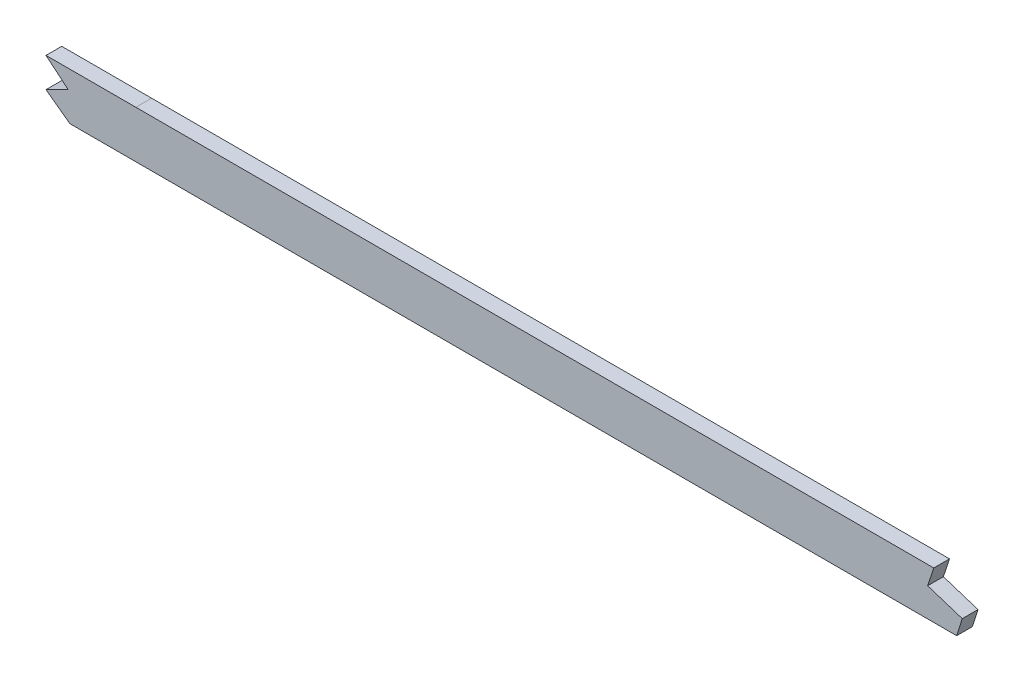
ISO-10303-21;
HEADER;
FILE_DESCRIPTION(('STEP AP214'),'2;1');
FILE_NAME('part.step','',(''),(''),'','','');
FILE_SCHEMA(('AUTOMOTIVE_DESIGN { 1 0 10303 214 1 1 1 1 }'));
ENDSEC;
DATA;
#1=APPLICATION_CONTEXT('core data for automotive mechanical design processes');
#2=APPLICATION_PROTOCOL_DEFINITION('international standard','automotive_design',2000,#1);
#3=PRODUCT_CONTEXT('',#1,'mechanical');
#4=PRODUCT('Part','Part','',(#3));
#5=PRODUCT_RELATED_PRODUCT_CATEGORY('part','',(#4));
#6=PRODUCT_DEFINITION_FORMATION('','',#4);
#7=PRODUCT_DEFINITION_CONTEXT('part definition',#1,'design');
#8=PRODUCT_DEFINITION('design','',#6,#7);
#9=PRODUCT_DEFINITION_SHAPE('','',#8);
#10=(LENGTH_UNIT() NAMED_UNIT(*) SI_UNIT(.MILLI.,.METRE.));
#11=(NAMED_UNIT(*) PLANE_ANGLE_UNIT() SI_UNIT($,.RADIAN.));
#12=(NAMED_UNIT(*) SI_UNIT($,.STERADIAN.) SOLID_ANGLE_UNIT());
#13=UNCERTAINTY_MEASURE_WITH_UNIT(LENGTH_MEASURE(1.E-05),#10,'distance_accuracy_value','');
#14=(GEOMETRIC_REPRESENTATION_CONTEXT(3) GLOBAL_UNCERTAINTY_ASSIGNED_CONTEXT((#13)) GLOBAL_UNIT_ASSIGNED_CONTEXT((#10,
#11,#12)) REPRESENTATION_CONTEXT('',''));
#15=CARTESIAN_POINT('',(0.,0.,0.));
#16=DIRECTION('',(0.,0.,1.));
#17=DIRECTION('',(1.,0.,0.));
#18=AXIS2_PLACEMENT_3D('',#15,#16,#17);
#19=CARTESIAN_POINT('',(499.61002795047,-34.4207027968771,3.175));
#20=CARTESIAN_POINT('',(488.614737518052,-34.4207027968771,3.175));
#21=CARTESIAN_POINT('',(472.2363953645,-34.4207027983821,3.175));
#22=CARTESIAN_POINT('',(449.940231846129,-34.420702794369,3.175));
#23=CARTESIAN_POINT('',(427.771305694794,-34.4207028104213,3.175));
#24=CARTESIAN_POINT('',(405.874681662796,-34.4207027121004,3.175));
#25=CARTESIAN_POINT('',(384.584909127846,-34.4207029418503,3.175));
#26=CARTESIAN_POINT('',(368.900229326161,-34.4207022443236,3.175));
#27=CARTESIAN_POINT('',(353.376568613047,-34.4207048621181,3.175));
#28=CARTESIAN_POINT('',(332.608466434546,-34.4206891858564,3.175));
#29=CARTESIAN_POINT('',(306.287754852687,-34.4205700055106,3.175));
#30=CARTESIAN_POINT('',(274.023487704489,-34.4205382555166,3.175));
#31=CARTESIAN_POINT('',(252.271015965112,-34.4207097406393,3.175));
#32=CARTESIAN_POINT('',(241.425150133728,-34.4207027610987,3.175));
#33=B_SPLINE_CURVE_WITH_KNOTS('',3,(#19,#20,#21,#22,#23,#24,#25,#26,#27,#28,#29,#30,#31,#32),
.UNSPECIFIED.,.F.,.F.,(4,1,1,1,1,1,1,1,1,1,1,4),(19.9068295096932,23.2201200173381,
24.8767652711605,26.5334105249829,29.8467010326278,31.5033462864503,33.1599915402727,
34.8166367940951,36.4732820479176,39.7865725555625,43.0998630632073,46.4131535708522),.UNSPECIFIED.);
#34=DIRECTION('',(0.,0.,-1.));
#35=VECTOR('',#34,1.);
#36=SURFACE_OF_LINEAR_EXTRUSION('',#33,#35);
#37=CARTESIAN_POINT('',(499.61002795047,-34.4207027968771,-3.175));
#38=CARTESIAN_POINT('',(488.614737518052,-34.4207027968771,-3.175));
#39=CARTESIAN_POINT('',(472.2363953645,-34.4207027983821,-3.175));
#40=CARTESIAN_POINT('',(449.940231846129,-34.420702794369,-3.175));
#41=CARTESIAN_POINT('',(427.771305694794,-34.4207028104213,-3.175));
#42=CARTESIAN_POINT('',(405.874681662796,-34.4207027121004,-3.175));
#43=CARTESIAN_POINT('',(384.584909127846,-34.4207029418503,-3.175));
#44=CARTESIAN_POINT('',(368.900229326161,-34.4207022443236,-3.175));
#45=CARTESIAN_POINT('',(353.376568613047,-34.4207048621181,-3.175));
#46=CARTESIAN_POINT('',(332.608466434546,-34.4206891858564,-3.175));
#47=CARTESIAN_POINT('',(306.287754852687,-34.4205700055106,-3.175));
#48=CARTESIAN_POINT('',(274.023487704489,-34.4205382555166,-3.175));
#49=CARTESIAN_POINT('',(252.271015965112,-34.4207097406393,-3.175));
#50=CARTESIAN_POINT('',(241.425150133728,-34.4207027610987,-3.175));
#51=B_SPLINE_CURVE_WITH_KNOTS('',3,(#37,#38,#39,#40,#41,#42,#43,#44,#45,#46,#47,#48,#49,#50),
.UNSPECIFIED.,.F.,.F.,(4,1,1,1,1,1,1,1,1,1,1,4),(19.9068295096932,23.2201200173381,
24.8767652711605,26.5334105249829,29.8467010326278,31.5033462864503,33.1599915402727,
34.8166367940951,36.4732820479176,39.7865725555625,43.0998630632073,46.4131535708522),.UNSPECIFIED.);
#52=CARTESIAN_POINT('',(499.61002795047,-34.4207027968771,-3.175));
#53=VERTEX_POINT('',#52);
#54=CARTESIAN_POINT('',(463.358597157252,-34.4207027965464,-3.175));
#55=VERTEX_POINT('',#54);
#56=EDGE_CURVE('E146',#53,#55,#51,.T.);
#57=ORIENTED_EDGE('',*,*,#56,.T.);
#58=DIRECTION('',(0.,0.,1.));
#59=VECTOR('',#58,1.);
#60=CARTESIAN_POINT('',(463.358597157252,-34.4207027965464,-4.445));
#61=LINE('',#60,#59);
#62=CARTESIAN_POINT('',(463.358597157252,-34.4207027965464,3.175));
#63=VERTEX_POINT('',#62);
#64=EDGE_CURVE('E147',#55,#63,#61,.T.);
#65=ORIENTED_EDGE('',*,*,#64,.T.);
#66=CARTESIAN_POINT('',(499.61002795047,-34.4207027968771,3.175));
#67=VERTEX_POINT('',#66);
#68=EDGE_CURVE('E173',#67,#63,#33,.T.);
#69=ORIENTED_EDGE('',*,*,#68,.F.);
#70=DIRECTION('',(0.,0.,-1.));
#71=VECTOR('',#70,1.);
#72=CARTESIAN_POINT('',(499.61002795047,-34.4207027968771,3.175));
#73=LINE('',#72,#71);
#74=EDGE_CURVE('E241',#67,#53,#73,.T.);
#75=ORIENTED_EDGE('',*,*,#74,.T.);
#76=EDGE_LOOP('',(#57,#65,#69,#75));
#77=FACE_BOUND('',#76,.T.);
#78=ADVANCED_FACE('F38',(#77),#36,.F.);
#79=CARTESIAN_POINT('',(499.61002795047,-53.4707027968771,3.175));
#80=CARTESIAN_POINT('',(492.13682083511,-53.4707027968771,3.175));
#81=CARTESIAN_POINT('',(484.754348064359,-53.4707027968771,3.175));
#82=CARTESIAN_POINT('',(477.443025858661,-53.4707027968771,3.175));
#83=CARTESIAN_POINT('',(448.516583144859,-53.4707027968771,3.175));
#84=CARTESIAN_POINT('',(419.590140516906,-53.4707027968771,3.175));
#85=CARTESIAN_POINT('',(398.368118521171,-53.4707027968771,3.175));
#86=CARTESIAN_POINT('',(355.647540185946,-53.4707027968771,3.175));
#87=CARTESIAN_POINT('',(312.926961850721,-53.4707027968771,3.175));
#88=CARTESIAN_POINT('',(289.235090436449,-53.4702930294301,3.175));
#89=CARTESIAN_POINT('',(265.364963651298,-53.4707050337029,3.175));
#90=CARTESIAN_POINT('',(241.494836900486,-53.4707027893221,3.175));
#91=CARTESIAN_POINT('',(241.471603890762,-53.470702784812,3.175));
#92=CARTESIAN_POINT('',(241.448370881994,-53.4707027760456,3.175));
#93=CARTESIAN_POINT('',(241.425137874656,-53.4707027610947,3.175));
#94=(BOUNDED_CURVE() B_SPLINE_CURVE(5,(#79,#80,#81,#82,#83,#84,#85,#86,#87,#88,#89,#90,#91,#92,
#93),.UNSPECIFIED.,.F.,.F.) B_SPLINE_CURVE_WITH_KNOTS((6,3,3,3,6),(19.9068295096932,
23.6378973105454,34.2765455705454,46.4013409005454,46.4131535708522),
.UNSPECIFIED.) CURVE() GEOMETRIC_REPRESENTATION_ITEM() RATIONAL_B_SPLINE_CURVE((1.,1.,1.,1.,1.,
1.,1.,1.,1.,1.,1.,1.,1.,1.,1.)) REPRESENTATION_ITEM(''));
#95=DIRECTION('',(0.,0.,-1.));
#96=VECTOR('',#95,1.);
#97=SURFACE_OF_LINEAR_EXTRUSION('',#94,#96);
#98=DIRECTION('',(0.,0.,1.));
#99=VECTOR('',#98,1.);
#100=CARTESIAN_POINT('',(472.997412796544,-53.4707027968771,-4.445));
#101=LINE('',#100,#99);
#102=CARTESIAN_POINT('',(472.997412796544,-53.4707027968771,-3.175));
#103=VERTEX_POINT('',#102);
#104=CARTESIAN_POINT('',(472.997412796544,-53.4707027968771,3.175));
#105=VERTEX_POINT('',#104);
#106=EDGE_CURVE('E130',#103,#105,#101,.T.);
#107=ORIENTED_EDGE('',*,*,#106,.F.);
#108=CARTESIAN_POINT('',(499.61002795047,-53.4707027968771,-3.175));
#109=CARTESIAN_POINT('',(492.13682083511,-53.4707027968771,-3.175));
#110=CARTESIAN_POINT('',(484.754348064359,-53.4707027968771,-3.175));
#111=CARTESIAN_POINT('',(477.443025858661,-53.4707027968771,-3.175));
#112=CARTESIAN_POINT('',(448.516583144859,-53.4707027968771,-3.175));
#113=CARTESIAN_POINT('',(419.590140516906,-53.4707027968771,-3.175));
#114=CARTESIAN_POINT('',(398.368118521171,-53.4707027968771,-3.175));
#115=CARTESIAN_POINT('',(355.647540185946,-53.4707027968771,-3.175));
#116=CARTESIAN_POINT('',(312.926961850721,-53.4707027968771,-3.175));
#117=CARTESIAN_POINT('',(289.235090436449,-53.4702930294301,-3.175));
#118=CARTESIAN_POINT('',(265.364963651298,-53.4707050337029,-3.175));
#119=CARTESIAN_POINT('',(241.494836900486,-53.4707027893221,-3.175));
#120=CARTESIAN_POINT('',(241.471603890762,-53.470702784812,-3.175));
#121=CARTESIAN_POINT('',(241.448370881994,-53.4707027760456,-3.175));
#122=CARTESIAN_POINT('',(241.425137874656,-53.4707027610947,-3.175));
#123=(BOUNDED_CURVE() B_SPLINE_CURVE(5,(#108,#109,#110,#111,#112,#113,#114,#115,#116,#117,#118,
#119,#120,#121,#122),.UNSPECIFIED.,.F.,.F.) B_SPLINE_CURVE_WITH_KNOTS((6,3,3,3,6),
(19.9068295096932,23.6378973105454,34.2765455705454,46.4013409005454,46.4131535708522),
.UNSPECIFIED.) CURVE() GEOMETRIC_REPRESENTATION_ITEM() RATIONAL_B_SPLINE_CURVE((1.,1.,1.,1.,1.,
1.,1.,1.,1.,1.,1.,1.,1.,1.,1.)) REPRESENTATION_ITEM(''));
#124=CARTESIAN_POINT('',(499.61002795047,-53.4707027968771,-3.175));
#125=VERTEX_POINT('',#124);
#126=EDGE_CURVE('E245',#125,#103,#123,.T.);
#127=ORIENTED_EDGE('',*,*,#126,.F.);
#128=DIRECTION('',(0.,0.,-1.));
#129=VECTOR('',#128,1.);
#130=CARTESIAN_POINT('',(499.61002795047,-53.4707027968771,3.175));
#131=LINE('',#130,#129);
#132=CARTESIAN_POINT('',(499.61002795047,-53.4707027968771,3.175));
#133=VERTEX_POINT('',#132);
#134=EDGE_CURVE('E269',#133,#125,#131,.T.);
#135=ORIENTED_EDGE('',*,*,#134,.F.);
#136=EDGE_CURVE('E179',#133,#105,#94,.T.);
#137=ORIENTED_EDGE('',*,*,#136,.T.);
#138=EDGE_LOOP('',(#107,#127,#135,#137));
#139=FACE_BOUND('',#138,.T.);
#140=ADVANCED_FACE('F194',(#139),#97,.T.);
#141=CARTESIAN_POINT('',(0.,-53.4707027968771,3.175));
#142=DIRECTION('',(0.,-1.,0.));
#143=DIRECTION('',(0.,0.,-1.));
#144=AXIS2_PLACEMENT_3D('',#141,#142,#143);
#145=PLANE('',#144);
#146=DIRECTION('',(0.,0.,1.));
#147=VECTOR('',#146,1.);
#148=CARTESIAN_POINT('',(830.756310041553,-53.4707027968771,-4.445));
#149=LINE('',#148,#147);
#150=CARTESIAN_POINT('',(830.756310041553,-53.4707027968771,-3.175));
#151=VERTEX_POINT('',#150);
#152=CARTESIAN_POINT('',(830.756310041553,-53.4707027968771,3.175));
#153=VERTEX_POINT('',#152);
#154=EDGE_CURVE('E135',#151,#153,#149,.T.);
#155=ORIENTED_EDGE('',*,*,#154,.T.);
#156=DIRECTION('',(-1.,0.,0.));
#157=VECTOR('',#156,1.);
#158=CARTESIAN_POINT('',(0.,-53.4707027968771,3.175));
#159=LINE('',#158,#157);
#160=EDGE_CURVE('E189',#153,#133,#159,.T.);
#161=ORIENTED_EDGE('',*,*,#160,.T.);
#162=ORIENTED_EDGE('',*,*,#134,.T.);
#163=DIRECTION('',(-1.,0.,0.));
#164=VECTOR('',#163,1.);
#165=CARTESIAN_POINT('',(0.,-53.4707027968771,-3.175));
#166=LINE('',#165,#164);
#167=EDGE_CURVE('E249',#151,#125,#166,.T.);
#168=ORIENTED_EDGE('',*,*,#167,.F.);
#169=EDGE_LOOP('',(#155,#161,#162,#168));
#170=FACE_BOUND('',#169,.T.);
#171=ADVANCED_FACE('F197',(#170),#145,.T.);
#172=CARTESIAN_POINT('',(0.,-34.4207027968772,3.175));
#173=DIRECTION('',(0.,-1.,0.));
#174=DIRECTION('',(1.,0.,0.));
#175=AXIS2_PLACEMENT_3D('',#172,#173,#174);
#176=PLANE('',#175);
#177=DIRECTION('',(-1.,0.,0.));
#178=VECTOR('',#177,1.);
#179=CARTESIAN_POINT('',(0.,-34.4207027968772,3.175));
#180=LINE('',#179,#178);
#181=CARTESIAN_POINT('',(821.518882755119,-34.4207027968771,3.175));
#182=VERTEX_POINT('',#181);
#183=EDGE_CURVE('E253',#182,#67,#180,.T.);
#184=ORIENTED_EDGE('',*,*,#183,.F.);
#185=DIRECTION('',(0.,0.,1.));
#186=VECTOR('',#185,1.);
#187=CARTESIAN_POINT('',(821.518882755119,-34.4207027968771,-4.445));
#188=LINE('',#187,#186);
#189=CARTESIAN_POINT('',(821.518882755119,-34.4207027968771,-3.175));
#190=VERTEX_POINT('',#189);
#191=EDGE_CURVE('E163',#190,#182,#188,.T.);
#192=ORIENTED_EDGE('',*,*,#191,.F.);
#193=DIRECTION('',(-1.,0.,0.));
#194=VECTOR('',#193,1.);
#195=CARTESIAN_POINT('',(0.,-34.4207027968772,-3.175));
#196=LINE('',#195,#194);
#197=EDGE_CURVE('E180',#190,#53,#196,.T.);
#198=ORIENTED_EDGE('',*,*,#197,.T.);
#199=ORIENTED_EDGE('',*,*,#74,.F.);
#200=EDGE_LOOP('',(#184,#192,#198,#199));
#201=FACE_BOUND('',#200,.T.);
#202=ADVANCED_FACE('F201',(#201),#176,.F.);
#203=CARTESIAN_POINT('',(0.,0.,3.175));
#204=DIRECTION('',(0.,0.,1.));
#205=DIRECTION('',(1.,0.,0.));
#206=AXIS2_PLACEMENT_3D('',#203,#204,#205);
#207=PLANE('',#206);
#208=DIRECTION('',(-0.805685409443556,0.592343667991622,0.));
#209=VECTOR('',#208,1.);
#210=CARTESIAN_POINT('',(463.358597157252,-46.3842006163091,3.175));
#211=LINE('',#210,#209);
#212=CARTESIAN_POINT('',(463.358597157252,-46.3842006163091,3.175));
#213=VERTEX_POINT('',#212);
#214=EDGE_CURVE('E127',#105,#213,#211,.T.);
#215=ORIENTED_EDGE('',*,*,#214,.F.);
#216=ORIENTED_EDGE('',*,*,#136,.F.);
#217=ORIENTED_EDGE('',*,*,#160,.F.);
#218=DIRECTION('',(-0.302432493069435,-0.953170806904936,0.));
#219=VECTOR('',#218,1.);
#220=CARTESIAN_POINT('',(833.004793215906,-46.3842006163091,3.175));
#221=LINE('',#220,#219);
#222=CARTESIAN_POINT('',(833.004793215906,-46.3842006163091,3.175));
#223=VERTEX_POINT('',#222);
#224=EDGE_CURVE('E160',#223,#153,#221,.T.);
#225=ORIENTED_EDGE('',*,*,#224,.F.);
#226=DIRECTION('',(0.951561635426516,-0.30745805239807,0.));
#227=VECTOR('',#226,1.);
#228=CARTESIAN_POINT('',(819.047328197418,-41.8744191673383,3.175));
#229=LINE('',#228,#227);
#230=CARTESIAN_POINT('',(819.047328197418,-41.8744191673383,3.175));
#231=VERTEX_POINT('',#230);
#232=EDGE_CURVE('E156',#231,#223,#229,.T.);
#233=ORIENTED_EDGE('',*,*,#232,.F.);
#234=DIRECTION('',(-0.314735447377986,-0.949179434123906,0.));
#235=VECTOR('',#234,1.);
#236=CARTESIAN_POINT('',(821.518882755119,-34.4207027968771,3.175));
#237=LINE('',#236,#235);
#238=EDGE_CURVE('E153',#182,#231,#237,.T.);
#239=ORIENTED_EDGE('',*,*,#238,.F.);
#240=ORIENTED_EDGE('',*,*,#183,.T.);
#241=ORIENTED_EDGE('',*,*,#68,.T.);
#242=DIRECTION('',(-0.767112549842051,0.641512537581945,0.));
#243=VECTOR('',#242,1.);
#244=CARTESIAN_POINT('',(463.358597157252,-34.4207027965464,3.175));
#245=LINE('',#244,#243);
#246=CARTESIAN_POINT('',(472.27165658482,-41.8744191673383,3.175));
#247=VERTEX_POINT('',#246);
#248=EDGE_CURVE('E124',#247,#63,#245,.T.);
#249=ORIENTED_EDGE('',*,*,#248,.F.);
#250=DIRECTION('',(0.892284614904802,0.451473328120488,0.));
#251=VECTOR('',#250,1.);
#252=CARTESIAN_POINT('',(472.27165658482,-41.8744191673383,3.175));
#253=LINE('',#252,#251);
#254=EDGE_CURVE('E118',#213,#247,#253,.T.);
#255=ORIENTED_EDGE('',*,*,#254,.F.);
#256=EDGE_LOOP('',(#215,#216,#217,#225,#233,#239,#240,#241,#249,#255));
#257=FACE_BOUND('',#256,.T.);
#258=ADVANCED_FACE('F137',(#257),#207,.T.);
#259=CARTESIAN_POINT('',(0.,0.,-3.175));
#260=DIRECTION('',(0.,0.,1.));
#261=DIRECTION('',(1.,0.,0.));
#262=AXIS2_PLACEMENT_3D('',#259,#260,#261);
#263=PLANE('',#262);
#264=ORIENTED_EDGE('',*,*,#126,.T.);
#265=DIRECTION('',(-0.805685409443556,0.592343667991622,0.));
#266=VECTOR('',#265,1.);
#267=CARTESIAN_POINT('',(140.442585226552,191.02515633402,-3.175));
#268=LINE('',#267,#266);
#269=CARTESIAN_POINT('',(463.358597157252,-46.3842006163091,-3.175));
#270=VERTEX_POINT('',#269);
#271=EDGE_CURVE('E11',#103,#270,#268,.T.);
#272=ORIENTED_EDGE('',*,*,#271,.T.);
#273=DIRECTION('',(0.892284614904802,0.451473328120488,0.));
#274=VECTOR('',#273,1.);
#275=CARTESIAN_POINT('',(113.131069893468,-223.590424608033,-3.175));
#276=LINE('',#275,#274);
#277=CARTESIAN_POINT('',(472.271656584819,-41.8744191673383,-3.175));
#278=VERTEX_POINT('',#277);
#279=EDGE_CURVE('E121',#270,#278,#276,.T.);
#280=ORIENTED_EDGE('',*,*,#279,.T.);
#281=DIRECTION('',(-0.767112549842051,0.641512537581945,0.));
#282=VECTOR('',#281,1.);
#283=CARTESIAN_POINT('',(173.750974131154,207.769209477475,-3.175));
#284=LINE('',#283,#282);
#285=EDGE_CURVE('E47',#278,#55,#284,.T.);
#286=ORIENTED_EDGE('',*,*,#285,.T.);
#287=ORIENTED_EDGE('',*,*,#56,.F.);
#288=ORIENTED_EDGE('',*,*,#197,.F.);
#289=DIRECTION('',(-0.314735447377986,-0.949179434123907,0.));
#290=VECTOR('',#289,1.);
#291=CARTESIAN_POINT('',(750.423390149356,-248.830550821575,-3.175));
#292=LINE('',#291,#290);
#293=CARTESIAN_POINT('',(819.047328197418,-41.8744191673383,-3.175));
#294=VERTEX_POINT('',#293);
#295=EDGE_CURVE('E273',#190,#294,#292,.T.);
#296=ORIENTED_EDGE('',*,*,#295,.T.);
#297=DIRECTION('',(0.951561635426516,-0.30745805239807,0.));
#298=VECTOR('',#297,1.);
#299=CARTESIAN_POINT('',(65.1739143006651,201.708805462653,-3.175));
#300=LINE('',#299,#298);
#301=CARTESIAN_POINT('',(833.004793215906,-46.3842006163091,-3.175));
#302=VERTEX_POINT('',#301);
#303=EDGE_CURVE('E277',#294,#302,#300,.T.);
#304=ORIENTED_EDGE('',*,*,#303,.T.);
#305=DIRECTION('',(-0.302432493069435,-0.953170806904936,0.));
#306=VECTOR('',#305,1.);
#307=CARTESIAN_POINT('',(770.184831209246,-244.372694735819,-3.175));
#308=LINE('',#307,#306);
#309=EDGE_CURVE('E281',#302,#151,#308,.T.);
#310=ORIENTED_EDGE('',*,*,#309,.T.);
#311=ORIENTED_EDGE('',*,*,#167,.T.);
#312=EDGE_LOOP('',(#264,#272,#280,#286,#287,#288,#296,#304,#310,#311));
#313=FACE_BOUND('',#312,.T.);
#314=ADVANCED_FACE('F206',(#313),#263,.F.);
#315=CARTESIAN_POINT('',(833.004793215906,-46.3842006163091,-4.445));
#316=DIRECTION('',(-0.953170806904936,0.302432493069435,0.));
#317=DIRECTION('',(-0.302432493069435,-0.953170806904936,0.));
#318=AXIS2_PLACEMENT_3D('',#315,#316,#317);
#319=PLANE('',#318);
#320=DIRECTION('',(0.,0.,1.));
#321=VECTOR('',#320,1.);
#322=CARTESIAN_POINT('',(833.004793215906,-46.3842006163091,-4.445));
#323=LINE('',#322,#321);
#324=EDGE_CURVE('E167',#302,#223,#323,.T.);
#325=ORIENTED_EDGE('',*,*,#324,.T.);
#326=ORIENTED_EDGE('',*,*,#224,.T.);
#327=ORIENTED_EDGE('',*,*,#154,.F.);
#328=ORIENTED_EDGE('',*,*,#309,.F.);
#329=EDGE_LOOP('',(#325,#326,#327,#328));
#330=FACE_BOUND('',#329,.T.);
#331=ADVANCED_FACE('F209',(#330),#319,.F.);
#332=CARTESIAN_POINT('',(819.047328197418,-41.8744191673383,-4.445));
#333=DIRECTION('',(-0.30745805239807,-0.951561635426516,0.));
#334=DIRECTION('',(0.951561635426516,-0.30745805239807,0.));
#335=AXIS2_PLACEMENT_3D('',#332,#333,#334);
#336=PLANE('',#335);
#337=DIRECTION('',(0.,0.,1.));
#338=VECTOR('',#337,1.);
#339=CARTESIAN_POINT('',(819.047328197418,-41.8744191673383,-4.445));
#340=LINE('',#339,#338);
#341=EDGE_CURVE('E62',#294,#231,#340,.T.);
#342=ORIENTED_EDGE('',*,*,#341,.T.);
#343=ORIENTED_EDGE('',*,*,#232,.T.);
#344=ORIENTED_EDGE('',*,*,#324,.F.);
#345=ORIENTED_EDGE('',*,*,#303,.F.);
#346=EDGE_LOOP('',(#342,#343,#344,#345));
#347=FACE_BOUND('',#346,.T.);
#348=ADVANCED_FACE('F216',(#347),#336,.F.);
#349=CARTESIAN_POINT('',(821.518882755119,-34.4207027968771,-4.445));
#350=DIRECTION('',(-0.949179434123906,0.314735447377986,0.));
#351=DIRECTION('',(-0.314735447377986,-0.949179434123907,0.));
#352=AXIS2_PLACEMENT_3D('',#349,#350,#351);
#353=PLANE('',#352);
#354=ORIENTED_EDGE('',*,*,#191,.T.);
#355=ORIENTED_EDGE('',*,*,#238,.T.);
#356=ORIENTED_EDGE('',*,*,#341,.F.);
#357=ORIENTED_EDGE('',*,*,#295,.F.);
#358=EDGE_LOOP('',(#354,#355,#356,#357));
#359=FACE_BOUND('',#358,.T.);
#360=ADVANCED_FACE('F213',(#359),#353,.F.);
#361=CARTESIAN_POINT('',(463.358597157252,-46.3842006163091,-4.445));
#362=DIRECTION('',(0.592343667991622,0.805685409443556,0.));
#363=DIRECTION('',(-0.805685409443556,0.592343667991622,0.));
#364=AXIS2_PLACEMENT_3D('',#361,#362,#363);
#365=PLANE('',#364);
#366=ORIENTED_EDGE('',*,*,#106,.T.);
#367=ORIENTED_EDGE('',*,*,#214,.T.);
#368=DIRECTION('',(0.,0.,1.));
#369=VECTOR('',#368,1.);
#370=CARTESIAN_POINT('',(463.358597157252,-46.3842006163091,-4.445));
#371=LINE('',#370,#369);
#372=EDGE_CURVE('E114',#270,#213,#371,.T.);
#373=ORIENTED_EDGE('',*,*,#372,.F.);
#374=ORIENTED_EDGE('',*,*,#271,.F.);
#375=EDGE_LOOP('',(#366,#367,#373,#374));
#376=FACE_BOUND('',#375,.T.);
#377=ADVANCED_FACE('F128',(#376),#365,.F.);
#378=CARTESIAN_POINT('',(463.358597157252,-34.4207027965464,-4.445));
#379=DIRECTION('',(0.641512537581945,0.767112549842051,0.));
#380=DIRECTION('',(-0.767112549842051,0.641512537581945,0.));
#381=AXIS2_PLACEMENT_3D('',#378,#379,#380);
#382=PLANE('',#381);
#383=DIRECTION('',(0.,0.,1.));
#384=VECTOR('',#383,1.);
#385=CARTESIAN_POINT('',(472.27165658482,-41.8744191673383,-4.445));
#386=LINE('',#385,#384);
#387=EDGE_CURVE('E54',#278,#247,#386,.T.);
#388=ORIENTED_EDGE('',*,*,#387,.T.);
#389=ORIENTED_EDGE('',*,*,#248,.T.);
#390=ORIENTED_EDGE('',*,*,#64,.F.);
#391=ORIENTED_EDGE('',*,*,#285,.F.);
#392=EDGE_LOOP('',(#388,#389,#390,#391));
#393=FACE_BOUND('',#392,.T.);
#394=ADVANCED_FACE('F225',(#393),#382,.F.);
#395=CARTESIAN_POINT('',(472.27165658482,-41.8744191673383,-4.445));
#396=DIRECTION('',(0.451473328120488,-0.892284614904802,0.));
#397=DIRECTION('',(0.892284614904802,0.451473328120488,0.));
#398=AXIS2_PLACEMENT_3D('',#395,#396,#397);
#399=PLANE('',#398);
#400=ORIENTED_EDGE('',*,*,#372,.T.);
#401=ORIENTED_EDGE('',*,*,#254,.T.);
#402=ORIENTED_EDGE('',*,*,#387,.F.);
#403=ORIENTED_EDGE('',*,*,#279,.F.);
#404=EDGE_LOOP('',(#400,#401,#402,#403));
#405=FACE_BOUND('',#404,.T.);
#406=ADVANCED_FACE('F116',(#405),#399,.F.);
#407=CLOSED_SHELL('',(#78,#140,#171,#202,#258,#314,#331,#348,#360,#377,#394,#406));
#408=MANIFOLD_SOLID_BREP('B2',#407);
#409=ADVANCED_BREP_SHAPE_REPRESENTATION('',(#18,#408),#14);
#410=SHAPE_DEFINITION_REPRESENTATION(#9,#409);
ENDSEC;
END-ISO-10303-21;
